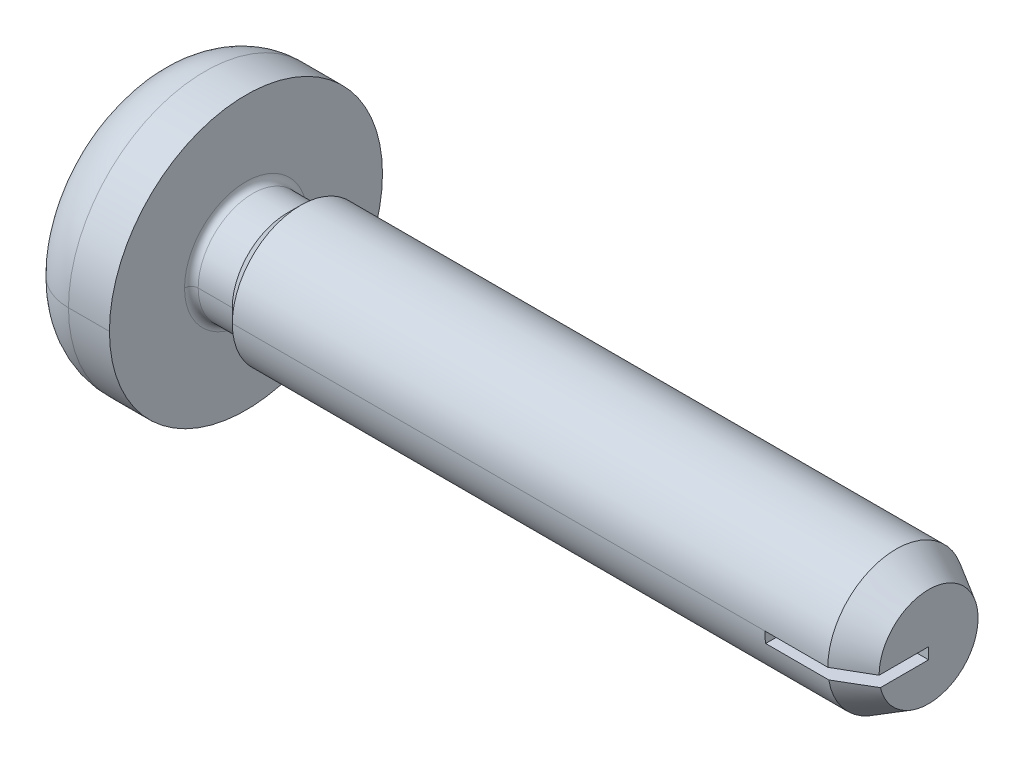
ISO-10303-21;
HEADER;
FILE_DESCRIPTION(('STEP AP214'),'2;1');
FILE_NAME('part.step','',(''),(''),'','','');
FILE_SCHEMA(('AUTOMOTIVE_DESIGN { 1 0 10303 214 1 1 1 1 }'));
ENDSEC;
DATA;
#1=APPLICATION_CONTEXT('core data for automotive mechanical design processes');
#2=APPLICATION_PROTOCOL_DEFINITION('international standard','automotive_design',2000,#1);
#3=PRODUCT_CONTEXT('',#1,'mechanical');
#4=PRODUCT('Part','Part','',(#3));
#5=PRODUCT_RELATED_PRODUCT_CATEGORY('part','',(#4));
#6=PRODUCT_DEFINITION_FORMATION('','',#4);
#7=PRODUCT_DEFINITION_CONTEXT('part definition',#1,'design');
#8=PRODUCT_DEFINITION('design','',#6,#7);
#9=PRODUCT_DEFINITION_SHAPE('','',#8);
#10=(LENGTH_UNIT() NAMED_UNIT(*) SI_UNIT(.MILLI.,.METRE.));
#11=(NAMED_UNIT(*) PLANE_ANGLE_UNIT() SI_UNIT($,.RADIAN.));
#12=(NAMED_UNIT(*) SI_UNIT($,.STERADIAN.) SOLID_ANGLE_UNIT());
#13=UNCERTAINTY_MEASURE_WITH_UNIT(LENGTH_MEASURE(1.E-05),#10,'distance_accuracy_value','');
#14=(GEOMETRIC_REPRESENTATION_CONTEXT(3) GLOBAL_UNCERTAINTY_ASSIGNED_CONTEXT((#13)) GLOBAL_UNIT_ASSIGNED_CONTEXT((#10,
#11,#12)) REPRESENTATION_CONTEXT('',''));
#15=CARTESIAN_POINT('',(0.,0.,0.));
#16=DIRECTION('',(0.,0.,1.));
#17=DIRECTION('',(1.,0.,0.));
#18=AXIS2_PLACEMENT_3D('',#15,#16,#17);
#19=CARTESIAN_POINT('',(11.4,0.,0.));
#20=DIRECTION('',(0.,0.,-1.));
#21=DIRECTION('',(0.,-1.,0.));
#22=AXIS2_PLACEMENT_3D('',#19,#20,#21);
#23=PLANE('',#22);
#24=DIRECTION('',(0.,1.,0.));
#25=VECTOR('',#24,1.);
#26=CARTESIAN_POINT('',(11.4,0.,0.));
#27=LINE('',#26,#25);
#28=CARTESIAN_POINT('',(11.4,-0.166666666666667,0.));
#29=VERTEX_POINT('',#28);
#30=CARTESIAN_POINT('',(11.4,0.,0.));
#31=VERTEX_POINT('',#30);
#32=EDGE_CURVE('E348',#29,#31,#27,.T.);
#33=ORIENTED_EDGE('',*,*,#32,.T.);
#34=DIRECTION('',(-1.,0.,0.));
#35=VECTOR('',#34,1.);
#36=CARTESIAN_POINT('',(11.4,0.,0.));
#37=LINE('',#36,#35);
#38=CARTESIAN_POINT('',(10.,0.,0.));
#39=VERTEX_POINT('',#38);
#40=EDGE_CURVE('E27',#31,#39,#37,.T.);
#41=ORIENTED_EDGE('',*,*,#40,.T.);
#42=DIRECTION('',(0.,-1.,0.));
#43=VECTOR('',#42,1.);
#44=CARTESIAN_POINT('',(10.,0.,0.));
#45=LINE('',#44,#43);
#46=CARTESIAN_POINT('',(10.,-0.166666666666667,0.));
#47=VERTEX_POINT('',#46);
#48=EDGE_CURVE('E311',#39,#47,#45,.T.);
#49=ORIENTED_EDGE('',*,*,#48,.T.);
#50=DIRECTION('',(1.,0.,0.));
#51=VECTOR('',#50,1.);
#52=CARTESIAN_POINT('',(11.4,-0.166666666666667,0.));
#53=LINE('',#52,#51);
#54=EDGE_CURVE('E11',#47,#29,#53,.T.);
#55=ORIENTED_EDGE('',*,*,#54,.T.);
#56=EDGE_LOOP('',(#33,#41,#49,#55));
#57=FACE_BOUND('',#56,.T.);
#58=ADVANCED_FACE('F16',(#57),#23,.F.);
#59=CARTESIAN_POINT('',(11.4,-0.166666666666667,2.));
#60=DIRECTION('',(0.,1.,0.));
#61=DIRECTION('',(1.,0.,0.));
#62=AXIS2_PLACEMENT_3D('',#59,#60,#61);
#63=PLANE('',#62);
#64=DIRECTION('',(1.,0.,0.));
#65=VECTOR('',#64,1.);
#66=CARTESIAN_POINT('',(0.,-0.166666666666669,0.986013297183269));
#67=LINE('',#66,#65);
#68=CARTESIAN_POINT('',(10.,-0.166666666666667,0.986013297183269));
#69=VERTEX_POINT('',#68);
#70=CARTESIAN_POINT('',(10.9236860279185,-0.166666666666667,0.98601329718327));
#71=VERTEX_POINT('',#70);
#72=EDGE_CURVE('E496',#69,#71,#67,.T.);
#73=ORIENTED_EDGE('',*,*,#72,.T.);
#74=CARTESIAN_POINT('',(11.4,-0.166666666666664,0.705582895358307));
#75=CARTESIAN_POINT('',(11.3830013099448,-0.166666959363702,0.715667010676969));
#76=CARTESIAN_POINT('',(11.3659974910884,-0.166669181672597,0.725742474908273));
#77=CARTESIAN_POINT('',(11.3311780257479,-0.166675338828007,0.746353442960602));
#78=CARTESIAN_POINT('',(11.3133619448213,-0.166679349559202,0.75688821286901));
#79=CARTESIAN_POINT('',(11.2769179881799,-0.166686625474541,0.778418137297358));
#80=CARTESIAN_POINT('',(11.2582897249311,-0.166689848895697,0.78941263576034));
#81=CARTESIAN_POINT('',(11.2202213396391,-0.166694363587721,0.81186207089951));
#82=CARTESIAN_POINT('',(11.2007808642041,-0.166695565501399,0.823316408304387));
#83=CARTESIAN_POINT('',(11.161088028488,-0.166695582341059,0.846685527933957));
#84=CARTESIAN_POINT('',(11.1408353442802,-0.166694296485835,0.858599759927783));
#85=CARTESIAN_POINT('',(11.0995180594433,-0.166689789509248,0.882888576039516));
#86=CARTESIAN_POINT('',(11.0784531590282,-0.166686493553965,0.895262650157091));
#87=CARTESIAN_POINT('',(11.0355114266237,-0.166679258106796,0.920471012457938));
#88=CARTESIAN_POINT('',(11.0136343156026,-0.166675298842382,0.933304825285911));
#89=CARTESIAN_POINT('',(10.9690681120226,-0.166669003188876,0.95943241077416));
#90=CARTESIAN_POINT('',(10.9463787566641,-0.16666673186243,0.972725735198832));
#91=CARTESIAN_POINT('',(10.9236860279185,-0.166666666666664,0.98601329718327));
#92=B_SPLINE_CURVE_WITH_KNOTS('',3,(#74,#75,#76,#77,#78,#79,#80,#81,#82,#83,#84,#85,#86,#87,#88,
#89,#90,#91),.UNSPECIFIED.,.F.,.F.,(4,2,2,2,2,2,2,2,4),(0.,0.059294205622965,0.121387249759108,
0.186279621922843,0.253971605069086,0.32446331069777,0.397754709070733,0.473845655864097,
0.552735916252413),.UNSPECIFIED.);
#93=CARTESIAN_POINT('',(11.4,-0.166666666666667,0.705582895358315));
#94=VERTEX_POINT('',#93);
#95=EDGE_CURVE('E370',#94,#71,#92,.T.);
#96=ORIENTED_EDGE('',*,*,#95,.F.);
#97=DIRECTION('',(0.,0.,-1.));
#98=VECTOR('',#97,1.);
#99=CARTESIAN_POINT('',(11.4,-0.166666666666667,0.));
#100=LINE('',#99,#98);
#101=EDGE_CURVE('E351',#94,#29,#100,.T.);
#102=ORIENTED_EDGE('',*,*,#101,.T.);
#103=ORIENTED_EDGE('',*,*,#54,.F.);
#104=DIRECTION('',(0.,0.,-1.));
#105=VECTOR('',#104,1.);
#106=CARTESIAN_POINT('',(10.,-0.166666666666667,2.));
#107=LINE('',#106,#105);
#108=EDGE_CURVE('E365',#69,#47,#107,.T.);
#109=ORIENTED_EDGE('',*,*,#108,.F.);
#110=EDGE_LOOP('',(#73,#96,#102,#103,#109));
#111=FACE_BOUND('',#110,.T.);
#112=ADVANCED_FACE('F442',(#111),#63,.T.);
#113=CARTESIAN_POINT('',(11.4,0.,2.));
#114=DIRECTION('',(0.,-1.,0.));
#115=DIRECTION('',(-1.,0.,0.));
#116=AXIS2_PLACEMENT_3D('',#113,#114,#115);
#117=PLANE('',#116);
#118=DIRECTION('',(-1.,0.,0.));
#119=VECTOR('',#118,1.);
#120=CARTESIAN_POINT('',(0.,0.,1.));
#121=LINE('',#120,#119);
#122=CARTESIAN_POINT('',(10.9236860279185,0.,1.));
#123=VERTEX_POINT('',#122);
#124=CARTESIAN_POINT('',(10.,0.,1.));
#125=VERTEX_POINT('',#124);
#126=EDGE_CURVE('E312',#123,#125,#121,.T.);
#127=ORIENTED_EDGE('',*,*,#126,.T.);
#128=DIRECTION('',(0.,0.,-1.));
#129=VECTOR('',#128,1.);
#130=CARTESIAN_POINT('',(10.,0.,2.));
#131=LINE('',#130,#129);
#132=EDGE_CURVE('E308',#125,#39,#131,.T.);
#133=ORIENTED_EDGE('',*,*,#132,.T.);
#134=ORIENTED_EDGE('',*,*,#40,.F.);
#135=DIRECTION('',(0.,0.,1.));
#136=VECTOR('',#135,1.);
#137=CARTESIAN_POINT('',(11.4,0.,0.));
#138=LINE('',#137,#136);
#139=CARTESIAN_POINT('',(11.4,0.,0.725));
#140=VERTEX_POINT('',#139);
#141=EDGE_CURVE('E352',#31,#140,#138,.T.);
#142=ORIENTED_EDGE('',*,*,#141,.T.);
#143=DIRECTION('',(0.86602540378444,0.,-0.5));
#144=VECTOR('',#143,1.);
#145=CARTESIAN_POINT('',(12.6557368354874,0.,0.));
#146=LINE('',#145,#144);
#147=EDGE_CURVE('E493',#123,#140,#146,.T.);
#148=ORIENTED_EDGE('',*,*,#147,.F.);
#149=EDGE_LOOP('',(#127,#133,#134,#142,#148));
#150=FACE_BOUND('',#149,.T.);
#151=ADVANCED_FACE('F438',(#150),#117,.T.);
#152=CARTESIAN_POINT('',(10.,0.,2.));
#153=DIRECTION('',(1.,0.,0.));
#154=DIRECTION('',(0.,1.,0.));
#155=AXIS2_PLACEMENT_3D('',#152,#153,#154);
#156=PLANE('',#155);
#157=CARTESIAN_POINT('',(10.,0.,0.));
#158=DIRECTION('',(1.,0.,0.));
#159=DIRECTION('',(0.,0.,-1.));
#160=AXIS2_PLACEMENT_3D('',#157,#158,#159);
#161=CIRCLE('',#160,1.);
#162=EDGE_CURVE('E499',#125,#69,#161,.T.);
#163=ORIENTED_EDGE('',*,*,#162,.T.);
#164=ORIENTED_EDGE('',*,*,#108,.T.);
#165=ORIENTED_EDGE('',*,*,#48,.F.);
#166=ORIENTED_EDGE('',*,*,#132,.F.);
#167=EDGE_LOOP('',(#163,#164,#165,#166));
#168=FACE_BOUND('',#167,.T.);
#169=ADVANCED_FACE('F441',(#168),#156,.T.);
#170=CARTESIAN_POINT('',(1.25264170234784,-0.479,0.265));
#171=DIRECTION('',(0.,-0.707106781186546,0.707106781186549));
#172=DIRECTION('',(-1.,0.,0.));
#173=AXIS2_PLACEMENT_3D('',#170,#171,#172);
#174=PLANE('',#173);
#175=DIRECTION('',(0.,-0.707106781186549,-0.707106781186546));
#176=VECTOR('',#175,1.);
#177=CARTESIAN_POINT('',(0.95,-0.479,0.265));
#178=LINE('',#177,#176);
#179=CARTESIAN_POINT('',(0.95,-0.265,0.479));
#180=VERTEX_POINT('',#179);
#181=CARTESIAN_POINT('',(0.95,-0.479,0.265));
#182=VERTEX_POINT('',#181);
#183=EDGE_CURVE('E582',#180,#182,#178,.T.);
#184=ORIENTED_EDGE('',*,*,#183,.T.);
#185=DIRECTION('',(-1.,0.,0.));
#186=VECTOR('',#185,1.);
#187=CARTESIAN_POINT('',(1.25264170234784,-0.479,0.265));
#188=LINE('',#187,#186);
#189=CARTESIAN_POINT('',(0.,-0.479,0.265));
#190=VERTEX_POINT('',#189);
#191=EDGE_CURVE('E326',#182,#190,#188,.T.);
#192=ORIENTED_EDGE('',*,*,#191,.T.);
#193=DIRECTION('',(0.,0.707106781186549,0.707106781186546));
#194=VECTOR('',#193,1.);
#195=CARTESIAN_POINT('',(0.,-0.479,0.265));
#196=LINE('',#195,#194);
#197=CARTESIAN_POINT('',(0.,-0.265,0.479));
#198=VERTEX_POINT('',#197);
#199=EDGE_CURVE('E546',#190,#198,#196,.T.);
#200=ORIENTED_EDGE('',*,*,#199,.T.);
#201=DIRECTION('',(-1.,0.,0.));
#202=VECTOR('',#201,1.);
#203=CARTESIAN_POINT('',(1.25264170234784,-0.265,0.479));
#204=LINE('',#203,#202);
#205=EDGE_CURVE('E541',#180,#198,#204,.T.);
#206=ORIENTED_EDGE('',*,*,#205,.F.);
#207=EDGE_LOOP('',(#184,#192,#200,#206));
#208=FACE_BOUND('',#207,.T.);
#209=ADVANCED_FACE('F449',(#208),#174,.F.);
#210=CARTESIAN_POINT('',(1.25264170234784,-0.479,-0.265));
#211=DIRECTION('',(0.,-0.707106781186546,-0.707106781186549));
#212=DIRECTION('',(0.,-0.707106781186549,0.707106781186546));
#213=AXIS2_PLACEMENT_3D('',#210,#211,#212);
#214=PLANE('',#213);
#215=DIRECTION('',(0.,0.707106781186549,-0.707106781186546));
#216=VECTOR('',#215,1.);
#217=CARTESIAN_POINT('',(0.95,-0.479,-0.265));
#218=LINE('',#217,#216);
#219=CARTESIAN_POINT('',(0.95,-0.479,-0.265));
#220=VERTEX_POINT('',#219);
#221=CARTESIAN_POINT('',(0.95,-0.265,-0.479));
#222=VERTEX_POINT('',#221);
#223=EDGE_CURVE('E607',#220,#222,#218,.T.);
#224=ORIENTED_EDGE('',*,*,#223,.T.);
#225=DIRECTION('',(-1.,0.,0.));
#226=VECTOR('',#225,1.);
#227=CARTESIAN_POINT('',(1.25264170234784,-0.265,-0.479));
#228=LINE('',#227,#226);
#229=CARTESIAN_POINT('',(0.,-0.265,-0.479));
#230=VERTEX_POINT('',#229);
#231=EDGE_CURVE('E573',#222,#230,#228,.T.);
#232=ORIENTED_EDGE('',*,*,#231,.T.);
#233=DIRECTION('',(0.,-0.707106781186549,0.707106781186546));
#234=VECTOR('',#233,1.);
#235=CARTESIAN_POINT('',(0.,-0.479,-0.265));
#236=LINE('',#235,#234);
#237=CARTESIAN_POINT('',(0.,-0.479,-0.265));
#238=VERTEX_POINT('',#237);
#239=EDGE_CURVE('E336',#230,#238,#236,.T.);
#240=ORIENTED_EDGE('',*,*,#239,.T.);
#241=DIRECTION('',(-1.,0.,0.));
#242=VECTOR('',#241,1.);
#243=CARTESIAN_POINT('',(1.25264170234784,-0.479,-0.265));
#244=LINE('',#243,#242);
#245=EDGE_CURVE('E574',#220,#238,#244,.T.);
#246=ORIENTED_EDGE('',*,*,#245,.F.);
#247=EDGE_LOOP('',(#224,#232,#240,#246));
#248=FACE_BOUND('',#247,.T.);
#249=ADVANCED_FACE('F433',(#248),#214,.F.);
#250=CARTESIAN_POINT('',(1.25264170234784,0.479,-0.265));
#251=DIRECTION('',(0.,0.707106781186547,-0.707106781186549));
#252=DIRECTION('',(-1.,0.,0.));
#253=AXIS2_PLACEMENT_3D('',#250,#251,#252);
#254=PLANE('',#253);
#255=DIRECTION('',(0.,0.707106781186549,0.707106781186547));
#256=VECTOR('',#255,1.);
#257=CARTESIAN_POINT('',(0.95,0.479,-0.265));
#258=LINE('',#257,#256);
#259=CARTESIAN_POINT('',(0.95,0.265,-0.479));
#260=VERTEX_POINT('',#259);
#261=CARTESIAN_POINT('',(0.95,0.479,-0.265));
#262=VERTEX_POINT('',#261);
#263=EDGE_CURVE('E604',#260,#262,#258,.T.);
#264=ORIENTED_EDGE('',*,*,#263,.T.);
#265=DIRECTION('',(-1.,0.,0.));
#266=VECTOR('',#265,1.);
#267=CARTESIAN_POINT('',(1.25264170234784,0.479,-0.265));
#268=LINE('',#267,#266);
#269=CARTESIAN_POINT('',(0.,0.479,-0.265));
#270=VERTEX_POINT('',#269);
#271=EDGE_CURVE('E627',#262,#270,#268,.T.);
#272=ORIENTED_EDGE('',*,*,#271,.T.);
#273=DIRECTION('',(0.,-0.707106781186549,-0.707106781186547));
#274=VECTOR('',#273,1.);
#275=CARTESIAN_POINT('',(0.,0.479,-0.265));
#276=LINE('',#275,#274);
#277=CARTESIAN_POINT('',(0.,0.265,-0.479));
#278=VERTEX_POINT('',#277);
#279=EDGE_CURVE('E942',#270,#278,#276,.T.);
#280=ORIENTED_EDGE('',*,*,#279,.T.);
#281=DIRECTION('',(-1.,0.,0.));
#282=VECTOR('',#281,1.);
#283=CARTESIAN_POINT('',(1.25264170234784,0.265,-0.479));
#284=LINE('',#283,#282);
#285=EDGE_CURVE('E358',#260,#278,#284,.T.);
#286=ORIENTED_EDGE('',*,*,#285,.F.);
#287=EDGE_LOOP('',(#264,#272,#280,#286));
#288=FACE_BOUND('',#287,.T.);
#289=ADVANCED_FACE('F429',(#288),#254,.F.);
#290=CARTESIAN_POINT('',(1.25264170234784,0.479,0.265));
#291=DIRECTION('',(0.,0.707106781186547,0.707106781186549));
#292=DIRECTION('',(1.,0.,0.));
#293=AXIS2_PLACEMENT_3D('',#290,#291,#292);
#294=PLANE('',#293);
#295=DIRECTION('',(0.,-0.707106781186549,0.707106781186547));
#296=VECTOR('',#295,1.);
#297=CARTESIAN_POINT('',(0.95,0.479,0.265));
#298=LINE('',#297,#296);
#299=CARTESIAN_POINT('',(0.95,0.479,0.265));
#300=VERTEX_POINT('',#299);
#301=CARTESIAN_POINT('',(0.95,0.265,0.479));
#302=VERTEX_POINT('',#301);
#303=EDGE_CURVE('E589',#300,#302,#298,.T.);
#304=ORIENTED_EDGE('',*,*,#303,.T.);
#305=DIRECTION('',(-1.,0.,0.));
#306=VECTOR('',#305,1.);
#307=CARTESIAN_POINT('',(1.25264170234784,0.265,0.479));
#308=LINE('',#307,#306);
#309=CARTESIAN_POINT('',(0.,0.265,0.479));
#310=VERTEX_POINT('',#309);
#311=EDGE_CURVE('E303',#302,#310,#308,.T.);
#312=ORIENTED_EDGE('',*,*,#311,.T.);
#313=DIRECTION('',(0.,0.707106781186549,-0.707106781186547));
#314=VECTOR('',#313,1.);
#315=CARTESIAN_POINT('',(0.,0.479,0.265));
#316=LINE('',#315,#314);
#317=CARTESIAN_POINT('',(0.,0.479,0.265));
#318=VERTEX_POINT('',#317);
#319=EDGE_CURVE('E555',#310,#318,#316,.T.);
#320=ORIENTED_EDGE('',*,*,#319,.T.);
#321=DIRECTION('',(-1.,0.,0.));
#322=VECTOR('',#321,1.);
#323=CARTESIAN_POINT('',(1.25264170234784,0.479,0.265));
#324=LINE('',#323,#322);
#325=EDGE_CURVE('E593',#300,#318,#324,.T.);
#326=ORIENTED_EDGE('',*,*,#325,.F.);
#327=EDGE_LOOP('',(#304,#312,#320,#326));
#328=FACE_BOUND('',#327,.T.);
#329=ADVANCED_FACE('F432',(#328),#294,.F.);
#330=CARTESIAN_POINT('',(0.95,0.265,-0.265));
#331=DIRECTION('',(-1.,0.,0.));
#332=DIRECTION('',(0.,0.,1.));
#333=AXIS2_PLACEMENT_3D('',#330,#331,#332);
#334=PLANE('',#333);
#335=DIRECTION('',(0.,-1.,0.));
#336=VECTOR('',#335,1.);
#337=CARTESIAN_POINT('',(0.95,-0.265,0.265));
#338=LINE('',#337,#336);
#339=CARTESIAN_POINT('',(0.95,-0.724228277447107,0.265));
#340=VERTEX_POINT('',#339);
#341=EDGE_CURVE('E321',#182,#340,#338,.T.);
#342=ORIENTED_EDGE('',*,*,#341,.F.);
#343=ORIENTED_EDGE('',*,*,#183,.F.);
#344=DIRECTION('',(0.,0.,-1.));
#345=VECTOR('',#344,1.);
#346=CARTESIAN_POINT('',(0.95,-0.265,0.265));
#347=LINE('',#346,#345);
#348=CARTESIAN_POINT('',(0.95,-0.265,0.724228277447107));
#349=VERTEX_POINT('',#348);
#350=EDGE_CURVE('E550',#349,#180,#347,.T.);
#351=ORIENTED_EDGE('',*,*,#350,.F.);
#352=DIRECTION('',(0.,-1.,0.));
#353=VECTOR('',#352,1.);
#354=CARTESIAN_POINT('',(0.95,0.265,0.724228277447107));
#355=LINE('',#354,#353);
#356=CARTESIAN_POINT('',(0.95,0.265,0.724228277447107));
#357=VERTEX_POINT('',#356);
#358=EDGE_CURVE('E320',#357,#349,#355,.T.);
#359=ORIENTED_EDGE('',*,*,#358,.F.);
#360=DIRECTION('',(0.,0.,1.));
#361=VECTOR('',#360,1.);
#362=CARTESIAN_POINT('',(0.95,0.265,0.265));
#363=LINE('',#362,#361);
#364=EDGE_CURVE('E306',#302,#357,#363,.T.);
#365=ORIENTED_EDGE('',*,*,#364,.F.);
#366=ORIENTED_EDGE('',*,*,#303,.F.);
#367=DIRECTION('',(0.,-1.,0.));
#368=VECTOR('',#367,1.);
#369=CARTESIAN_POINT('',(0.95,1.07,0.265));
#370=LINE('',#369,#368);
#371=CARTESIAN_POINT('',(0.95,0.724228277447107,0.265));
#372=VERTEX_POINT('',#371);
#373=EDGE_CURVE('E307',#372,#300,#370,.T.);
#374=ORIENTED_EDGE('',*,*,#373,.F.);
#375=DIRECTION('',(0.,0.,1.));
#376=VECTOR('',#375,1.);
#377=CARTESIAN_POINT('',(0.95,0.724228277447107,-0.265));
#378=LINE('',#377,#376);
#379=CARTESIAN_POINT('',(0.95,0.724228277447107,-0.265));
#380=VERTEX_POINT('',#379);
#381=EDGE_CURVE('E297',#380,#372,#378,.T.);
#382=ORIENTED_EDGE('',*,*,#381,.F.);
#383=DIRECTION('',(0.,1.,0.));
#384=VECTOR('',#383,1.);
#385=CARTESIAN_POINT('',(0.95,1.07,-0.265));
#386=LINE('',#385,#384);
#387=EDGE_CURVE('E868',#262,#380,#386,.T.);
#388=ORIENTED_EDGE('',*,*,#387,.F.);
#389=ORIENTED_EDGE('',*,*,#263,.F.);
#390=DIRECTION('',(0.,0.,1.));
#391=VECTOR('',#390,1.);
#392=CARTESIAN_POINT('',(0.95,0.265,-1.07));
#393=LINE('',#392,#391);
#394=CARTESIAN_POINT('',(0.95,0.265,-0.724228277447106));
#395=VERTEX_POINT('',#394);
#396=EDGE_CURVE('E361',#395,#260,#393,.T.);
#397=ORIENTED_EDGE('',*,*,#396,.F.);
#398=DIRECTION('',(0.,1.,0.));
#399=VECTOR('',#398,1.);
#400=CARTESIAN_POINT('',(0.95,0.265,-0.724228277447106));
#401=LINE('',#400,#399);
#402=CARTESIAN_POINT('',(0.95,-0.265,-0.724228277447107));
#403=VERTEX_POINT('',#402);
#404=EDGE_CURVE('E356',#403,#395,#401,.T.);
#405=ORIENTED_EDGE('',*,*,#404,.F.);
#406=DIRECTION('',(0.,0.,-1.));
#407=VECTOR('',#406,1.);
#408=CARTESIAN_POINT('',(0.95,-0.265,-1.07));
#409=LINE('',#408,#407);
#410=EDGE_CURVE('E357',#222,#403,#409,.T.);
#411=ORIENTED_EDGE('',*,*,#410,.F.);
#412=ORIENTED_EDGE('',*,*,#223,.F.);
#413=DIRECTION('',(0.,1.,0.));
#414=VECTOR('',#413,1.);
#415=CARTESIAN_POINT('',(0.95,-0.265,-0.265));
#416=LINE('',#415,#414);
#417=CARTESIAN_POINT('',(0.95,-0.724228277447107,-0.265));
#418=VERTEX_POINT('',#417);
#419=EDGE_CURVE('E569',#418,#220,#416,.T.);
#420=ORIENTED_EDGE('',*,*,#419,.F.);
#421=DIRECTION('',(0.,0.,-1.));
#422=VECTOR('',#421,1.);
#423=CARTESIAN_POINT('',(0.95,-0.724228277447107,-0.265));
#424=LINE('',#423,#422);
#425=EDGE_CURVE('E535',#340,#418,#424,.T.);
#426=ORIENTED_EDGE('',*,*,#425,.F.);
#427=EDGE_LOOP('',(#342,#343,#351,#359,#365,#366,#374,#382,#388,#389,#397,#405,#411,#412,#420,#426));
#428=FACE_BOUND('',#427,.T.);
#429=ADVANCED_FACE('F392',(#428),#334,.T.);
#430=CARTESIAN_POINT('',(0.95,0.265,-1.07));
#431=DIRECTION('',(0.,-1.,0.));
#432=DIRECTION('',(0.,0.,-1.));
#433=AXIS2_PLACEMENT_3D('',#430,#431,#432);
#434=PLANE('',#433);
#435=ORIENTED_EDGE('',*,*,#285,.T.);
#436=DIRECTION('',(0.,0.,1.));
#437=VECTOR('',#436,1.);
#438=CARTESIAN_POINT('',(0.,0.265,-1.07));
#439=LINE('',#438,#437);
#440=CARTESIAN_POINT('',(0.,0.265,-1.07));
#441=VERTEX_POINT('',#440);
#442=EDGE_CURVE('E947',#441,#278,#439,.T.);
#443=ORIENTED_EDGE('',*,*,#442,.F.);
#444=DIRECTION('',(-0.939692620785908,0.,-0.342020143325669));
#445=VECTOR('',#444,1.);
#446=CARTESIAN_POINT('',(0.838871110481514,0.265,-0.764675885398893));
#447=LINE('',#446,#445);
#448=EDGE_CURVE('E362',#395,#441,#447,.T.);
#449=ORIENTED_EDGE('',*,*,#448,.F.);
#450=ORIENTED_EDGE('',*,*,#396,.T.);
#451=EDGE_LOOP('',(#435,#443,#449,#450));
#452=FACE_BOUND('',#451,.T.);
#453=ADVANCED_FACE('F388',(#452),#434,.T.);
#454=CARTESIAN_POINT('',(0.,0.265,-1.07));
#455=DIRECTION('',(-0.342020143325669,0.,0.939692620785908));
#456=DIRECTION('',(0.,1.,0.));
#457=AXIS2_PLACEMENT_3D('',#454,#455,#456);
#458=PLANE('',#457);
#459=DIRECTION('',(0.,1.,0.));
#460=VECTOR('',#459,1.);
#461=CARTESIAN_POINT('',(0.,0.265,-1.07));
#462=LINE('',#461,#460);
#463=CARTESIAN_POINT('',(0.,-0.265,-1.07));
#464=VERTEX_POINT('',#463);
#465=EDGE_CURVE('E586',#464,#441,#462,.T.);
#466=ORIENTED_EDGE('',*,*,#465,.F.);
#467=DIRECTION('',(-0.939692620785908,0.,-0.342020143325669));
#468=VECTOR('',#467,1.);
#469=CARTESIAN_POINT('',(0.,-0.265,-1.07));
#470=LINE('',#469,#468);
#471=EDGE_CURVE('E353',#403,#464,#470,.T.);
#472=ORIENTED_EDGE('',*,*,#471,.F.);
#473=ORIENTED_EDGE('',*,*,#404,.T.);
#474=ORIENTED_EDGE('',*,*,#448,.T.);
#475=EDGE_LOOP('',(#466,#472,#473,#474));
#476=FACE_BOUND('',#475,.T.);
#477=ADVANCED_FACE('F391',(#476),#458,.T.);
#478=CARTESIAN_POINT('',(0.95,-0.265,-1.07));
#479=DIRECTION('',(0.,1.,0.));
#480=DIRECTION('',(0.,0.,-1.));
#481=AXIS2_PLACEMENT_3D('',#478,#479,#480);
#482=PLANE('',#481);
#483=ORIENTED_EDGE('',*,*,#231,.F.);
#484=ORIENTED_EDGE('',*,*,#410,.T.);
#485=ORIENTED_EDGE('',*,*,#471,.T.);
#486=DIRECTION('',(0.,0.,-1.));
#487=VECTOR('',#486,1.);
#488=CARTESIAN_POINT('',(0.,-0.265,-1.07));
#489=LINE('',#488,#487);
#490=EDGE_CURVE('E341',#230,#464,#489,.T.);
#491=ORIENTED_EDGE('',*,*,#490,.F.);
#492=EDGE_LOOP('',(#483,#484,#485,#491));
#493=FACE_BOUND('',#492,.T.);
#494=ADVANCED_FACE('F460',(#493),#482,.T.);
#495=CARTESIAN_POINT('',(0.95,-0.265,-0.265));
#496=DIRECTION('',(0.,0.,1.));
#497=DIRECTION('',(1.,0.,0.));
#498=AXIS2_PLACEMENT_3D('',#495,#496,#497);
#499=PLANE('',#498);
#500=ORIENTED_EDGE('',*,*,#245,.T.);
#501=DIRECTION('',(0.,1.,0.));
#502=VECTOR('',#501,1.);
#503=CARTESIAN_POINT('',(0.,-0.265,-0.265));
#504=LINE('',#503,#502);
#505=CARTESIAN_POINT('',(0.,-1.07,-0.265));
#506=VERTEX_POINT('',#505);
#507=EDGE_CURVE('E332',#506,#238,#504,.T.);
#508=ORIENTED_EDGE('',*,*,#507,.F.);
#509=DIRECTION('',(-0.939692620785908,-0.342020143325669,0.));
#510=VECTOR('',#509,1.);
#511=CARTESIAN_POINT('',(1.09759312338035,-0.670508773754281,-0.265));
#512=LINE('',#511,#510);
#513=EDGE_CURVE('E538',#418,#506,#512,.T.);
#514=ORIENTED_EDGE('',*,*,#513,.F.);
#515=ORIENTED_EDGE('',*,*,#419,.T.);
#516=EDGE_LOOP('',(#500,#508,#514,#515));
#517=FACE_BOUND('',#516,.T.);
#518=ADVANCED_FACE('F467',(#517),#499,.T.);
#519=CARTESIAN_POINT('',(0.,-1.07,-0.265));
#520=DIRECTION('',(-0.342020143325669,0.939692620785908,0.));
#521=DIRECTION('',(0.,0.,1.));
#522=AXIS2_PLACEMENT_3D('',#519,#520,#521);
#523=PLANE('',#522);
#524=DIRECTION('',(0.,0.,-1.));
#525=VECTOR('',#524,1.);
#526=CARTESIAN_POINT('',(0.,-1.07,-0.265));
#527=LINE('',#526,#525);
#528=CARTESIAN_POINT('',(0.,-1.07,0.265));
#529=VERTEX_POINT('',#528);
#530=EDGE_CURVE('E337',#529,#506,#527,.T.);
#531=ORIENTED_EDGE('',*,*,#530,.F.);
#532=DIRECTION('',(-0.939692620785908,-0.342020143325669,0.));
#533=VECTOR('',#532,1.);
#534=CARTESIAN_POINT('',(0.,-1.07,0.265));
#535=LINE('',#534,#533);
#536=EDGE_CURVE('E325',#340,#529,#535,.T.);
#537=ORIENTED_EDGE('',*,*,#536,.F.);
#538=ORIENTED_EDGE('',*,*,#425,.T.);
#539=ORIENTED_EDGE('',*,*,#513,.T.);
#540=EDGE_LOOP('',(#531,#537,#538,#539));
#541=FACE_BOUND('',#540,.T.);
#542=ADVANCED_FACE('F456',(#541),#523,.T.);
#543=CARTESIAN_POINT('',(0.95,-0.265,0.265));
#544=DIRECTION('',(0.,0.,-1.));
#545=DIRECTION('',(0.,-1.,0.));
#546=AXIS2_PLACEMENT_3D('',#543,#544,#545);
#547=PLANE('',#546);
#548=ORIENTED_EDGE('',*,*,#191,.F.);
#549=ORIENTED_EDGE('',*,*,#341,.T.);
#550=ORIENTED_EDGE('',*,*,#536,.T.);
#551=DIRECTION('',(0.,-1.,0.));
#552=VECTOR('',#551,1.);
#553=CARTESIAN_POINT('',(0.,-0.265,0.265));
#554=LINE('',#553,#552);
#555=EDGE_CURVE('E543',#190,#529,#554,.T.);
#556=ORIENTED_EDGE('',*,*,#555,.F.);
#557=EDGE_LOOP('',(#548,#549,#550,#556));
#558=FACE_BOUND('',#557,.T.);
#559=ADVANCED_FACE('F453',(#558),#547,.T.);
#560=CARTESIAN_POINT('',(0.95,-0.265,0.265));
#561=DIRECTION('',(0.,1.,0.));
#562=DIRECTION('',(0.,0.,-1.));
#563=AXIS2_PLACEMENT_3D('',#560,#561,#562);
#564=PLANE('',#563);
#565=ORIENTED_EDGE('',*,*,#205,.T.);
#566=DIRECTION('',(0.,0.,-1.));
#567=VECTOR('',#566,1.);
#568=CARTESIAN_POINT('',(0.,-0.265,0.265));
#569=LINE('',#568,#567);
#570=CARTESIAN_POINT('',(0.,-0.265,1.07));
#571=VERTEX_POINT('',#570);
#572=EDGE_CURVE('E564',#571,#198,#569,.T.);
#573=ORIENTED_EDGE('',*,*,#572,.F.);
#574=DIRECTION('',(-0.939692620785908,0.,0.342020143325669));
#575=VECTOR('',#574,1.);
#576=CARTESIAN_POINT('',(1.09759312338035,-0.265,0.670508773754281));
#577=LINE('',#576,#575);
#578=EDGE_CURVE('E534',#349,#571,#577,.T.);
#579=ORIENTED_EDGE('',*,*,#578,.F.);
#580=ORIENTED_EDGE('',*,*,#350,.T.);
#581=EDGE_LOOP('',(#565,#573,#579,#580));
#582=FACE_BOUND('',#581,.T.);
#583=ADVANCED_FACE('F413',(#582),#564,.T.);
#584=CARTESIAN_POINT('',(0.,0.265,1.07));
#585=DIRECTION('',(-0.342020143325669,0.,-0.939692620785908));
#586=DIRECTION('',(-0.939692620785908,0.,0.342020143325669));
#587=AXIS2_PLACEMENT_3D('',#584,#585,#586);
#588=PLANE('',#587);
#589=DIRECTION('',(0.,-1.,0.));
#590=VECTOR('',#589,1.);
#591=CARTESIAN_POINT('',(0.,0.265,1.07));
#592=LINE('',#591,#590);
#593=CARTESIAN_POINT('',(0.,0.265,1.07));
#594=VERTEX_POINT('',#593);
#595=EDGE_CURVE('E617',#594,#571,#592,.T.);
#596=ORIENTED_EDGE('',*,*,#595,.F.);
#597=DIRECTION('',(-0.939692620785908,0.,0.342020143325669));
#598=VECTOR('',#597,1.);
#599=CARTESIAN_POINT('',(0.,0.265,1.07));
#600=LINE('',#599,#598);
#601=EDGE_CURVE('E317',#357,#594,#600,.T.);
#602=ORIENTED_EDGE('',*,*,#601,.F.);
#603=ORIENTED_EDGE('',*,*,#358,.T.);
#604=ORIENTED_EDGE('',*,*,#578,.T.);
#605=EDGE_LOOP('',(#596,#602,#603,#604));
#606=FACE_BOUND('',#605,.T.);
#607=ADVANCED_FACE('F409',(#606),#588,.T.);
#608=CARTESIAN_POINT('',(0.95,0.265,0.265));
#609=DIRECTION('',(0.,-1.,0.));
#610=DIRECTION('',(0.,0.,-1.));
#611=AXIS2_PLACEMENT_3D('',#608,#609,#610);
#612=PLANE('',#611);
#613=ORIENTED_EDGE('',*,*,#311,.F.);
#614=ORIENTED_EDGE('',*,*,#364,.T.);
#615=ORIENTED_EDGE('',*,*,#601,.T.);
#616=DIRECTION('',(0.,0.,1.));
#617=VECTOR('',#616,1.);
#618=CARTESIAN_POINT('',(0.,0.265,0.265));
#619=LINE('',#618,#617);
#620=EDGE_CURVE('E559',#310,#594,#619,.T.);
#621=ORIENTED_EDGE('',*,*,#620,.F.);
#622=EDGE_LOOP('',(#613,#614,#615,#621));
#623=FACE_BOUND('',#622,.T.);
#624=ADVANCED_FACE('F412',(#623),#612,.T.);
#625=CARTESIAN_POINT('',(0.95,1.07,0.265));
#626=DIRECTION('',(0.,0.,-1.));
#627=DIRECTION('',(-1.,0.,0.));
#628=AXIS2_PLACEMENT_3D('',#625,#626,#627);
#629=PLANE('',#628);
#630=ORIENTED_EDGE('',*,*,#325,.T.);
#631=DIRECTION('',(0.,-1.,0.));
#632=VECTOR('',#631,1.);
#633=CARTESIAN_POINT('',(0.,1.07,0.265));
#634=LINE('',#633,#632);
#635=CARTESIAN_POINT('',(0.,1.07,0.265));
#636=VERTEX_POINT('',#635);
#637=EDGE_CURVE('E560',#636,#318,#634,.T.);
#638=ORIENTED_EDGE('',*,*,#637,.F.);
#639=DIRECTION('',(-0.939692620785908,0.342020143325669,0.));
#640=VECTOR('',#639,1.);
#641=CARTESIAN_POINT('',(0.838871110481514,0.764675885398893,0.265));
#642=LINE('',#641,#640);
#643=EDGE_CURVE('E301',#372,#636,#642,.T.);
#644=ORIENTED_EDGE('',*,*,#643,.F.);
#645=ORIENTED_EDGE('',*,*,#373,.T.);
#646=EDGE_LOOP('',(#630,#638,#644,#645));
#647=FACE_BOUND('',#646,.T.);
#648=ADVANCED_FACE('F403',(#647),#629,.T.);
#649=CARTESIAN_POINT('',(0.,1.07,-0.265));
#650=DIRECTION('',(-0.342020143325669,-0.939692620785908,0.));
#651=DIRECTION('',(-0.939692620785908,0.342020143325669,0.));
#652=AXIS2_PLACEMENT_3D('',#649,#650,#651);
#653=PLANE('',#652);
#654=DIRECTION('',(0.,0.,1.));
#655=VECTOR('',#654,1.);
#656=CARTESIAN_POINT('',(0.,1.07,-0.265));
#657=LINE('',#656,#655);
#658=CARTESIAN_POINT('',(0.,1.07,-0.265));
#659=VERTEX_POINT('',#658);
#660=EDGE_CURVE('E600',#659,#636,#657,.T.);
#661=ORIENTED_EDGE('',*,*,#660,.F.);
#662=DIRECTION('',(-0.939692620785908,0.342020143325669,0.));
#663=VECTOR('',#662,1.);
#664=CARTESIAN_POINT('',(0.,1.07,-0.265));
#665=LINE('',#664,#663);
#666=EDGE_CURVE('E302',#380,#659,#665,.T.);
#667=ORIENTED_EDGE('',*,*,#666,.F.);
#668=ORIENTED_EDGE('',*,*,#381,.T.);
#669=ORIENTED_EDGE('',*,*,#643,.T.);
#670=EDGE_LOOP('',(#661,#667,#668,#669));
#671=FACE_BOUND('',#670,.T.);
#672=ADVANCED_FACE('F399',(#671),#653,.T.);
#673=CARTESIAN_POINT('',(0.95,1.07,-0.265));
#674=DIRECTION('',(0.,0.,1.));
#675=DIRECTION('',(1.,0.,0.));
#676=AXIS2_PLACEMENT_3D('',#673,#674,#675);
#677=PLANE('',#676);
#678=ORIENTED_EDGE('',*,*,#271,.F.);
#679=ORIENTED_EDGE('',*,*,#387,.T.);
#680=ORIENTED_EDGE('',*,*,#666,.T.);
#681=DIRECTION('',(0.,1.,0.));
#682=VECTOR('',#681,1.);
#683=CARTESIAN_POINT('',(0.,1.07,-0.265));
#684=LINE('',#683,#682);
#685=EDGE_CURVE('E637',#270,#659,#684,.T.);
#686=ORIENTED_EDGE('',*,*,#685,.F.);
#687=EDGE_LOOP('',(#678,#679,#680,#686));
#688=FACE_BOUND('',#687,.T.);
#689=ADVANCED_FACE('F402',(#688),#677,.T.);
#690=CARTESIAN_POINT('',(0.8,0.,0.));
#691=DIRECTION('',(-1.,0.,0.));
#692=DIRECTION('',(0.,0.,1.));
#693=AXIS2_PLACEMENT_3D('',#690,#691,#692);
#694=TOROIDAL_SURFACE('',#693,1.2,0.8);
#695=CARTESIAN_POINT('',(0.8,0.,-1.2));
#696=DIRECTION('',(0.,1.,0.));
#697=DIRECTION('',(0.,0.,1.));
#698=AXIS2_PLACEMENT_3D('',#695,#696,#697);
#699=CIRCLE('',#698,0.8);
#700=CARTESIAN_POINT('',(0.8,0.,-2.));
#701=VERTEX_POINT('',#700);
#702=CARTESIAN_POINT('',(0.,0.,-1.2));
#703=VERTEX_POINT('',#702);
#704=EDGE_CURVE('E331',#701,#703,#699,.T.);
#705=ORIENTED_EDGE('',*,*,#704,.F.);
#706=CARTESIAN_POINT('',(0.8,0.,0.));
#707=DIRECTION('',(-1.,0.,0.));
#708=DIRECTION('',(0.,0.,1.));
#709=AXIS2_PLACEMENT_3D('',#706,#707,#708);
#710=CIRCLE('',#709,2.);
#711=CARTESIAN_POINT('',(0.8,0.,2.));
#712=VERTEX_POINT('',#711);
#713=EDGE_CURVE('E624',#701,#712,#710,.T.);
#714=ORIENTED_EDGE('',*,*,#713,.T.);
#715=CARTESIAN_POINT('',(0.8,0.,1.2));
#716=DIRECTION('',(0.,-1.,0.));
#717=DIRECTION('',(0.,0.,-1.));
#718=AXIS2_PLACEMENT_3D('',#715,#716,#717);
#719=CIRCLE('',#718,0.8);
#720=CARTESIAN_POINT('',(0.,0.,1.2));
#721=VERTEX_POINT('',#720);
#722=EDGE_CURVE('E342',#712,#721,#719,.T.);
#723=ORIENTED_EDGE('',*,*,#722,.T.);
#724=CARTESIAN_POINT('',(0.,0.,0.));
#725=DIRECTION('',(-1.,0.,0.));
#726=DIRECTION('',(0.,0.,1.));
#727=AXIS2_PLACEMENT_3D('',#724,#725,#726);
#728=CIRCLE('',#727,1.2);
#729=EDGE_CURVE('E487',#703,#721,#728,.T.);
#730=ORIENTED_EDGE('',*,*,#729,.F.);
#731=EDGE_LOOP('',(#705,#714,#723,#730));
#732=FACE_BOUND('',#731,.T.);
#733=ADVANCED_FACE('F18',(#732),#694,.T.);
#734=CARTESIAN_POINT('',(0.,0.,0.));
#735=DIRECTION('',(-1.,0.,0.));
#736=DIRECTION('',(0.,0.,1.));
#737=AXIS2_PLACEMENT_3D('',#734,#735,#736);
#738=CYLINDRICAL_SURFACE('',#737,2.);
#739=DIRECTION('',(-1.,0.,0.));
#740=VECTOR('',#739,1.);
#741=CARTESIAN_POINT('',(0.,0.,-2.));
#742=LINE('',#741,#740);
#743=CARTESIAN_POINT('',(1.4,0.,-2.));
#744=VERTEX_POINT('',#743);
#745=EDGE_CURVE('E551',#744,#701,#742,.T.);
#746=ORIENTED_EDGE('',*,*,#745,.F.);
#747=CARTESIAN_POINT('',(1.4,0.,0.));
#748=DIRECTION('',(-1.,0.,0.));
#749=DIRECTION('',(0.,0.,1.));
#750=AXIS2_PLACEMENT_3D('',#747,#748,#749);
#751=CIRCLE('',#750,2.);
#752=CARTESIAN_POINT('',(1.4,0.,2.));
#753=VERTEX_POINT('',#752);
#754=EDGE_CURVE('E628',#744,#753,#751,.T.);
#755=ORIENTED_EDGE('',*,*,#754,.T.);
#756=DIRECTION('',(-1.,0.,0.));
#757=VECTOR('',#756,1.);
#758=CARTESIAN_POINT('',(0.,0.,2.));
#759=LINE('',#758,#757);
#760=EDGE_CURVE('E291',#753,#712,#759,.T.);
#761=ORIENTED_EDGE('',*,*,#760,.T.);
#762=ORIENTED_EDGE('',*,*,#713,.F.);
#763=EDGE_LOOP('',(#746,#755,#761,#762));
#764=FACE_BOUND('',#763,.T.);
#765=ADVANCED_FACE('F1407',(#764),#738,.T.);
#766=CARTESIAN_POINT('',(1.4,2.,0.));
#767=DIRECTION('',(-1.,0.,0.));
#768=DIRECTION('',(0.,0.,1.));
#769=AXIS2_PLACEMENT_3D('',#766,#767,#768);
#770=PLANE('',#769);
#771=CARTESIAN_POINT('',(1.4,0.,0.));
#772=DIRECTION('',(-1.,0.,0.));
#773=DIRECTION('',(0.,0.,1.));
#774=AXIS2_PLACEMENT_3D('',#771,#772,#773);
#775=CIRCLE('',#774,0.9);
#776=CARTESIAN_POINT('',(1.4,0.,0.9));
#777=VERTEX_POINT('',#776);
#778=CARTESIAN_POINT('',(1.4,0.,-0.9));
#779=VERTEX_POINT('',#778);
#780=EDGE_CURVE('E616',#777,#779,#775,.T.);
#781=ORIENTED_EDGE('',*,*,#780,.T.);
#782=CARTESIAN_POINT('',(1.4,0.,0.));
#783=DIRECTION('',(-1.,0.,0.));
#784=DIRECTION('',(0.,0.,1.));
#785=AXIS2_PLACEMENT_3D('',#782,#783,#784);
#786=CIRCLE('',#785,0.9);
#787=EDGE_CURVE('E283',#779,#777,#786,.T.);
#788=ORIENTED_EDGE('',*,*,#787,.T.);
#789=EDGE_LOOP('',(#781,#788));
#790=FACE_BOUND('',#789,.T.);
#791=CARTESIAN_POINT('',(1.4,0.,0.));
#792=DIRECTION('',(-1.,0.,0.));
#793=DIRECTION('',(0.,0.,1.));
#794=AXIS2_PLACEMENT_3D('',#791,#792,#793);
#795=CIRCLE('',#794,2.);
#796=EDGE_CURVE('E346',#753,#744,#795,.T.);
#797=ORIENTED_EDGE('',*,*,#796,.F.);
#798=ORIENTED_EDGE('',*,*,#754,.F.);
#799=EDGE_LOOP('',(#797,#798));
#800=FACE_BOUND('',#799,.T.);
#801=ADVANCED_FACE('F1369',(#790,#800),#770,.F.);
#802=CARTESIAN_POINT('',(1.5,0.,0.));
#803=DIRECTION('',(-1.,0.,0.));
#804=DIRECTION('',(0.,0.,1.));
#805=AXIS2_PLACEMENT_3D('',#802,#803,#804);
#806=TOROIDAL_SURFACE('',#805,0.9,0.1);
#807=CARTESIAN_POINT('',(1.5,0.,-0.9));
#808=DIRECTION('',(0.,1.,0.));
#809=DIRECTION('',(0.,0.,1.));
#810=AXIS2_PLACEMENT_3D('',#807,#808,#809);
#811=CIRCLE('',#810,0.1);
#812=CARTESIAN_POINT('',(1.5,0.,-0.8));
#813=VERTEX_POINT('',#812);
#814=EDGE_CURVE('E260',#779,#813,#811,.T.);
#815=ORIENTED_EDGE('',*,*,#814,.F.);
#816=ORIENTED_EDGE('',*,*,#780,.F.);
#817=CARTESIAN_POINT('',(1.5,0.,0.9));
#818=DIRECTION('',(0.,-1.,0.));
#819=DIRECTION('',(0.,0.,-1.));
#820=AXIS2_PLACEMENT_3D('',#817,#818,#819);
#821=CIRCLE('',#820,0.1);
#822=CARTESIAN_POINT('',(1.5,0.,0.8));
#823=VERTEX_POINT('',#822);
#824=EDGE_CURVE('E263',#777,#823,#821,.T.);
#825=ORIENTED_EDGE('',*,*,#824,.T.);
#826=CARTESIAN_POINT('',(1.5,0.,0.));
#827=DIRECTION('',(-1.,0.,0.));
#828=DIRECTION('',(0.,0.,1.));
#829=AXIS2_PLACEMENT_3D('',#826,#827,#828);
#830=CIRCLE('',#829,0.8);
#831=EDGE_CURVE('E256',#823,#813,#830,.T.);
#832=ORIENTED_EDGE('',*,*,#831,.T.);
#833=EDGE_LOOP('',(#815,#816,#825,#832));
#834=FACE_BOUND('',#833,.T.);
#835=ADVANCED_FACE('F258',(#834),#806,.F.);
#836=CARTESIAN_POINT('',(0.,0.,0.));
#837=DIRECTION('',(-1.,0.,0.));
#838=DIRECTION('',(0.,0.,1.));
#839=AXIS2_PLACEMENT_3D('',#836,#837,#838);
#840=CYLINDRICAL_SURFACE('',#839,0.8);
#841=DIRECTION('',(-1.,0.,0.));
#842=VECTOR('',#841,1.);
#843=CARTESIAN_POINT('',(0.,0.,-0.8));
#844=LINE('',#843,#842);
#845=CARTESIAN_POINT('',(2.,0.,-0.8));
#846=VERTEX_POINT('',#845);
#847=EDGE_CURVE('E267',#846,#813,#844,.T.);
#848=ORIENTED_EDGE('',*,*,#847,.F.);
#849=CARTESIAN_POINT('',(2.,0.,0.));
#850=DIRECTION('',(-1.,0.,0.));
#851=DIRECTION('',(0.,0.,1.));
#852=AXIS2_PLACEMENT_3D('',#849,#850,#851);
#853=CIRCLE('',#852,0.8);
#854=CARTESIAN_POINT('',(2.,0.,0.8));
#855=VERTEX_POINT('',#854);
#856=EDGE_CURVE('E613',#846,#855,#853,.T.);
#857=ORIENTED_EDGE('',*,*,#856,.T.);
#858=DIRECTION('',(-1.,0.,0.));
#859=VECTOR('',#858,1.);
#860=CARTESIAN_POINT('',(0.,0.,0.8));
#861=LINE('',#860,#859);
#862=EDGE_CURVE('E247',#855,#823,#861,.T.);
#863=ORIENTED_EDGE('',*,*,#862,.T.);
#864=CARTESIAN_POINT('',(1.5,0.,0.));
#865=DIRECTION('',(-1.,0.,0.));
#866=DIRECTION('',(0.,0.,1.));
#867=AXIS2_PLACEMENT_3D('',#864,#865,#866);
#868=CIRCLE('',#867,0.8);
#869=EDGE_CURVE('E276',#813,#823,#868,.T.);
#870=ORIENTED_EDGE('',*,*,#869,.F.);
#871=EDGE_LOOP('',(#848,#857,#863,#870));
#872=FACE_BOUND('',#871,.T.);
#873=ADVANCED_FACE('F277',(#872),#840,.T.);
#874=CARTESIAN_POINT('',(2.2,0.,0.));
#875=DIRECTION('',(1.,0.,0.));
#876=DIRECTION('',(0.,0.,-1.));
#877=AXIS2_PLACEMENT_3D('',#874,#875,#876);
#878=CONICAL_SURFACE('',#877,1.,0.78539816339745);
#879=DIRECTION('',(0.707106781186546,0.,0.707106781186549));
#880=VECTOR('',#879,1.);
#881=CARTESIAN_POINT('',(2.2,0.,1.));
#882=LINE('',#881,#880);
#883=CARTESIAN_POINT('',(2.2,0.,1.));
#884=VERTEX_POINT('',#883);
#885=EDGE_CURVE('E646',#855,#884,#882,.T.);
#886=ORIENTED_EDGE('',*,*,#885,.F.);
#887=ORIENTED_EDGE('',*,*,#856,.F.);
#888=DIRECTION('',(0.707106781186546,0.,-0.707106781186549));
#889=VECTOR('',#888,1.);
#890=CARTESIAN_POINT('',(2.2,0.,-1.));
#891=LINE('',#890,#889);
#892=CARTESIAN_POINT('',(2.2,0.,-1.));
#893=VERTEX_POINT('',#892);
#894=EDGE_CURVE('E516',#846,#893,#891,.T.);
#895=ORIENTED_EDGE('',*,*,#894,.T.);
#896=CARTESIAN_POINT('',(2.2,0.,0.));
#897=DIRECTION('',(-1.,0.,0.));
#898=DIRECTION('',(0.,0.,1.));
#899=AXIS2_PLACEMENT_3D('',#896,#897,#898);
#900=CIRCLE('',#899,1.);
#901=EDGE_CURVE('E623',#893,#884,#900,.T.);
#902=ORIENTED_EDGE('',*,*,#901,.T.);
#903=EDGE_LOOP('',(#886,#887,#895,#902));
#904=FACE_BOUND('',#903,.T.);
#905=ADVANCED_FACE('F425',(#904),#878,.T.);
#906=CARTESIAN_POINT('',(0.,0.,0.));
#907=DIRECTION('',(1.,0.,0.));
#908=DIRECTION('',(0.,1.,0.));
#909=AXIS2_PLACEMENT_3D('',#906,#907,#908);
#910=PLANE('',#909);
#911=ORIENTED_EDGE('',*,*,#572,.T.);
#912=ORIENTED_EDGE('',*,*,#199,.F.);
#913=ORIENTED_EDGE('',*,*,#555,.T.);
#914=ORIENTED_EDGE('',*,*,#530,.T.);
#915=ORIENTED_EDGE('',*,*,#507,.T.);
#916=ORIENTED_EDGE('',*,*,#239,.F.);
#917=ORIENTED_EDGE('',*,*,#490,.T.);
#918=ORIENTED_EDGE('',*,*,#465,.T.);
#919=ORIENTED_EDGE('',*,*,#442,.T.);
#920=ORIENTED_EDGE('',*,*,#279,.F.);
#921=ORIENTED_EDGE('',*,*,#685,.T.);
#922=ORIENTED_EDGE('',*,*,#660,.T.);
#923=ORIENTED_EDGE('',*,*,#637,.T.);
#924=ORIENTED_EDGE('',*,*,#319,.F.);
#925=ORIENTED_EDGE('',*,*,#620,.T.);
#926=ORIENTED_EDGE('',*,*,#595,.T.);
#927=EDGE_LOOP('',(#911,#912,#913,#914,#915,#916,#917,#918,#919,#920,#921,#922,#923,#924,#925,#926));
#928=FACE_BOUND('',#927,.T.);
#929=CARTESIAN_POINT('',(0.,0.,0.));
#930=DIRECTION('',(-1.,0.,0.));
#931=DIRECTION('',(0.,0.,1.));
#932=AXIS2_PLACEMENT_3D('',#929,#930,#931);
#933=CIRCLE('',#932,1.2);
#934=EDGE_CURVE('E347',#721,#703,#933,.T.);
#935=ORIENTED_EDGE('',*,*,#934,.T.);
#936=ORIENTED_EDGE('',*,*,#729,.T.);
#937=EDGE_LOOP('',(#935,#936));
#938=FACE_BOUND('',#937,.T.);
#939=ADVANCED_FACE('F421',(#928,#938),#910,.F.);
#940=CARTESIAN_POINT('',(11.4,1.,0.));
#941=DIRECTION('',(-1.,0.,0.));
#942=DIRECTION('',(0.,0.,1.));
#943=AXIS2_PLACEMENT_3D('',#940,#941,#942);
#944=PLANE('',#943);
#945=ORIENTED_EDGE('',*,*,#141,.F.);
#946=ORIENTED_EDGE('',*,*,#32,.F.);
#947=ORIENTED_EDGE('',*,*,#101,.F.);
#948=CARTESIAN_POINT('',(11.4,0.,0.));
#949=DIRECTION('',(-1.,0.,0.));
#950=DIRECTION('',(0.,0.,1.));
#951=AXIS2_PLACEMENT_3D('',#948,#949,#950);
#952=CIRCLE('',#951,0.725);
#953=EDGE_CURVE('E490',#140,#94,#952,.T.);
#954=ORIENTED_EDGE('',*,*,#953,.F.);
#955=EDGE_LOOP('',(#945,#946,#947,#954));
#956=FACE_BOUND('',#955,.T.);
#957=ADVANCED_FACE('F387',(#956),#944,.F.);
#958=CARTESIAN_POINT('',(10.9236860279185,0.,0.));
#959=DIRECTION('',(-1.,0.,0.));
#960=DIRECTION('',(0.,0.,1.));
#961=AXIS2_PLACEMENT_3D('',#958,#959,#960);
#962=CONICAL_SURFACE('',#961,1.,0.523598775598298);
#963=CARTESIAN_POINT('',(10.9236860279185,0.,0.));
#964=DIRECTION('',(-1.,0.,0.));
#965=DIRECTION('',(0.,0.,1.));
#966=AXIS2_PLACEMENT_3D('',#963,#964,#965);
#967=CIRCLE('',#966,1.);
#968=CARTESIAN_POINT('',(10.9236860279185,0.,-1.));
#969=VERTEX_POINT('',#968);
#970=EDGE_CURVE('E513',#123,#969,#967,.T.);
#971=ORIENTED_EDGE('',*,*,#970,.F.);
#972=ORIENTED_EDGE('',*,*,#147,.T.);
#973=ORIENTED_EDGE('',*,*,#953,.T.);
#974=ORIENTED_EDGE('',*,*,#95,.T.);
#975=CARTESIAN_POINT('',(10.9236860279185,0.,0.));
#976=DIRECTION('',(-1.,0.,0.));
#977=DIRECTION('',(0.,0.,1.));
#978=AXIS2_PLACEMENT_3D('',#975,#976,#977);
#979=CIRCLE('',#978,1.);
#980=EDGE_CURVE('E316',#969,#71,#979,.T.);
#981=ORIENTED_EDGE('',*,*,#980,.F.);
#982=EDGE_LOOP('',(#971,#972,#973,#974,#981));
#983=FACE_BOUND('',#982,.T.);
#984=ADVANCED_FACE('F377',(#983),#962,.T.);
#985=CARTESIAN_POINT('',(0.,0.,0.));
#986=DIRECTION('',(-1.,0.,0.));
#987=DIRECTION('',(0.,0.,1.));
#988=AXIS2_PLACEMENT_3D('',#985,#986,#987);
#989=CYLINDRICAL_SURFACE('',#988,1.);
#990=DIRECTION('',(-1.,0.,0.));
#991=VECTOR('',#990,1.);
#992=CARTESIAN_POINT('',(0.,0.,-1.));
#993=LINE('',#992,#991);
#994=EDGE_CURVE('E509',#969,#893,#993,.T.);
#995=ORIENTED_EDGE('',*,*,#994,.F.);
#996=ORIENTED_EDGE('',*,*,#980,.T.);
#997=ORIENTED_EDGE('',*,*,#72,.F.);
#998=ORIENTED_EDGE('',*,*,#162,.F.);
#999=DIRECTION('',(-1.,0.,0.));
#1000=VECTOR('',#999,1.);
#1001=CARTESIAN_POINT('',(0.,0.,1.));
#1002=LINE('',#1001,#1000);
#1003=EDGE_CURVE('E295',#125,#884,#1002,.T.);
#1004=ORIENTED_EDGE('',*,*,#1003,.T.);
#1005=ORIENTED_EDGE('',*,*,#901,.F.);
#1006=EDGE_LOOP('',(#995,#996,#997,#998,#1004,#1005));
#1007=FACE_BOUND('',#1006,.T.);
#1008=ADVANCED_FACE('F386',(#1007),#989,.T.);
#1009=CARTESIAN_POINT('',(0.,0.,0.));
#1010=DIRECTION('',(-1.,0.,0.));
#1011=DIRECTION('',(0.,0.,1.));
#1012=AXIS2_PLACEMENT_3D('',#1009,#1010,#1011);
#1013=CYLINDRICAL_SURFACE('',#1012,1.);
#1014=ORIENTED_EDGE('',*,*,#970,.T.);
#1015=ORIENTED_EDGE('',*,*,#994,.T.);
#1016=CARTESIAN_POINT('',(2.2,0.,0.));
#1017=DIRECTION('',(-1.,0.,0.));
#1018=DIRECTION('',(0.,0.,1.));
#1019=AXIS2_PLACEMENT_3D('',#1016,#1017,#1018);
#1020=CIRCLE('',#1019,1.);
#1021=EDGE_CURVE('E523',#884,#893,#1020,.T.);
#1022=ORIENTED_EDGE('',*,*,#1021,.F.);
#1023=ORIENTED_EDGE('',*,*,#1003,.F.);
#1024=ORIENTED_EDGE('',*,*,#126,.F.);
#1025=EDGE_LOOP('',(#1014,#1015,#1022,#1023,#1024));
#1026=FACE_BOUND('',#1025,.T.);
#1027=ADVANCED_FACE('F407',(#1026),#1013,.T.);
#1028=CARTESIAN_POINT('',(2.2,0.,0.));
#1029=DIRECTION('',(1.,0.,0.));
#1030=DIRECTION('',(0.,0.,-1.));
#1031=AXIS2_PLACEMENT_3D('',#1028,#1029,#1030);
#1032=CONICAL_SURFACE('',#1031,1.,0.78539816339745);
#1033=CARTESIAN_POINT('',(2.,0.,0.));
#1034=DIRECTION('',(-1.,0.,0.));
#1035=DIRECTION('',(0.,0.,1.));
#1036=AXIS2_PLACEMENT_3D('',#1033,#1034,#1035);
#1037=CIRCLE('',#1036,0.8);
#1038=EDGE_CURVE('E273',#855,#846,#1037,.T.);
#1039=ORIENTED_EDGE('',*,*,#1038,.F.);
#1040=ORIENTED_EDGE('',*,*,#885,.T.);
#1041=ORIENTED_EDGE('',*,*,#1021,.T.);
#1042=ORIENTED_EDGE('',*,*,#894,.F.);
#1043=EDGE_LOOP('',(#1039,#1040,#1041,#1042));
#1044=FACE_BOUND('',#1043,.T.);
#1045=ADVANCED_FACE('F415',(#1044),#1032,.T.);
#1046=CARTESIAN_POINT('',(0.,0.,0.));
#1047=DIRECTION('',(-1.,0.,0.));
#1048=DIRECTION('',(0.,0.,1.));
#1049=AXIS2_PLACEMENT_3D('',#1046,#1047,#1048);
#1050=CYLINDRICAL_SURFACE('',#1049,0.8);
#1051=ORIENTED_EDGE('',*,*,#1038,.T.);
#1052=ORIENTED_EDGE('',*,*,#847,.T.);
#1053=ORIENTED_EDGE('',*,*,#831,.F.);
#1054=ORIENTED_EDGE('',*,*,#862,.F.);
#1055=EDGE_LOOP('',(#1051,#1052,#1053,#1054));
#1056=FACE_BOUND('',#1055,.T.);
#1057=ADVANCED_FACE('F271',(#1056),#1050,.T.);
#1058=CARTESIAN_POINT('',(1.5,0.,0.));
#1059=DIRECTION('',(-1.,0.,0.));
#1060=DIRECTION('',(0.,0.,1.));
#1061=AXIS2_PLACEMENT_3D('',#1058,#1059,#1060);
#1062=TOROIDAL_SURFACE('',#1061,0.9,0.1);
#1063=ORIENTED_EDGE('',*,*,#787,.F.);
#1064=ORIENTED_EDGE('',*,*,#814,.T.);
#1065=ORIENTED_EDGE('',*,*,#869,.T.);
#1066=ORIENTED_EDGE('',*,*,#824,.F.);
#1067=EDGE_LOOP('',(#1063,#1064,#1065,#1066));
#1068=FACE_BOUND('',#1067,.T.);
#1069=ADVANCED_FACE('F281',(#1068),#1062,.F.);
#1070=CARTESIAN_POINT('',(0.,0.,0.));
#1071=DIRECTION('',(-1.,0.,0.));
#1072=DIRECTION('',(0.,0.,1.));
#1073=AXIS2_PLACEMENT_3D('',#1070,#1071,#1072);
#1074=CYLINDRICAL_SURFACE('',#1073,2.);
#1075=ORIENTED_EDGE('',*,*,#796,.T.);
#1076=ORIENTED_EDGE('',*,*,#745,.T.);
#1077=CARTESIAN_POINT('',(0.8,0.,0.));
#1078=DIRECTION('',(-1.,0.,0.));
#1079=DIRECTION('',(0.,0.,1.));
#1080=AXIS2_PLACEMENT_3D('',#1077,#1078,#1079);
#1081=CIRCLE('',#1080,2.);
#1082=EDGE_CURVE('E327',#712,#701,#1081,.T.);
#1083=ORIENTED_EDGE('',*,*,#1082,.F.);
#1084=ORIENTED_EDGE('',*,*,#760,.F.);
#1085=EDGE_LOOP('',(#1075,#1076,#1083,#1084));
#1086=FACE_BOUND('',#1085,.T.);
#1087=ADVANCED_FACE('F397',(#1086),#1074,.T.);
#1088=CARTESIAN_POINT('',(0.8,0.,0.));
#1089=DIRECTION('',(-1.,0.,0.));
#1090=DIRECTION('',(0.,0.,1.));
#1091=AXIS2_PLACEMENT_3D('',#1088,#1089,#1090);
#1092=TOROIDAL_SURFACE('',#1091,1.2,0.8);
#1093=ORIENTED_EDGE('',*,*,#1082,.T.);
#1094=ORIENTED_EDGE('',*,*,#704,.T.);
#1095=ORIENTED_EDGE('',*,*,#934,.F.);
#1096=ORIENTED_EDGE('',*,*,#722,.F.);
#1097=EDGE_LOOP('',(#1093,#1094,#1095,#1096));
#1098=FACE_BOUND('',#1097,.T.);
#1099=ADVANCED_FACE('F394',(#1098),#1092,.T.);
#1100=CLOSED_SHELL('',(#58,#112,#151,#169,#209,#249,#289,#329,#429,#453,#477,#494,#518,#542,
#559,#583,#607,#624,#648,#672,#689,#733,#765,#801,#835,#873,#905,#939,#957,#984,#1008,#1027,
#1045,#1057,#1069,#1087,#1099));
#1101=MANIFOLD_SOLID_BREP('B1',#1100);
#1102=ADVANCED_BREP_SHAPE_REPRESENTATION('',(#18,#1101),#14);
#1103=SHAPE_DEFINITION_REPRESENTATION(#9,#1102);
ENDSEC;
END-ISO-10303-21;
